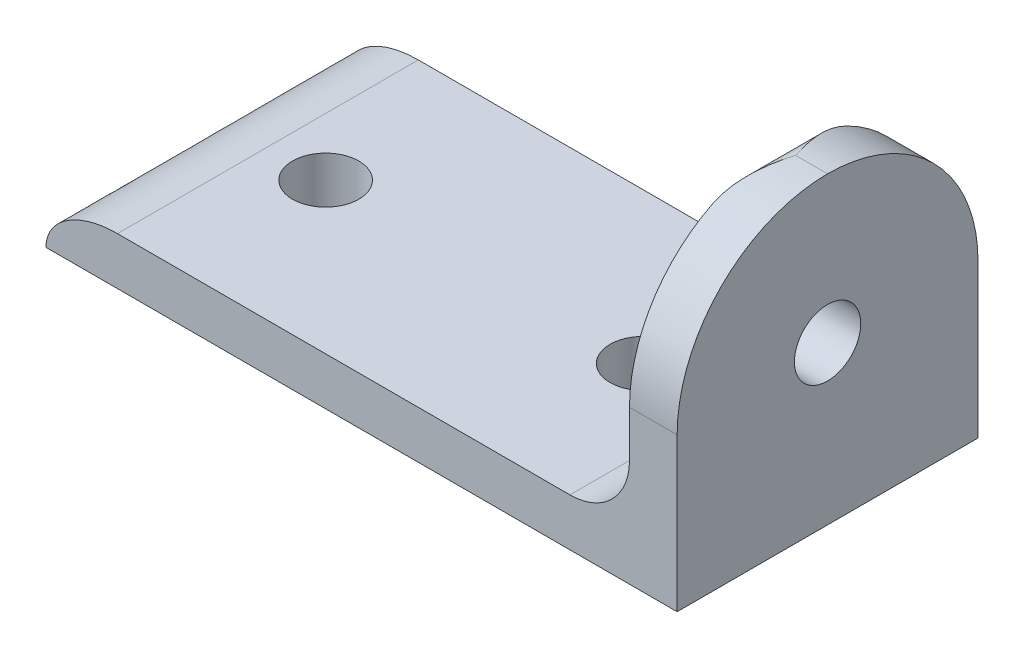
ISO-10303-21;
HEADER;
FILE_DESCRIPTION(('STEP AP214'),'2;1');
FILE_NAME('part.step','',(''),(''),'','','');
FILE_SCHEMA(('AUTOMOTIVE_DESIGN { 1 0 10303 214 1 1 1 1 }'));
ENDSEC;
DATA;
#1=APPLICATION_CONTEXT('core data for automotive mechanical design processes');
#2=APPLICATION_PROTOCOL_DEFINITION('international standard','automotive_design',2000,#1);
#3=PRODUCT_CONTEXT('',#1,'mechanical');
#4=PRODUCT('Part','Part','',(#3));
#5=PRODUCT_RELATED_PRODUCT_CATEGORY('part','',(#4));
#6=PRODUCT_DEFINITION_FORMATION('','',#4);
#7=PRODUCT_DEFINITION_CONTEXT('part definition',#1,'design');
#8=PRODUCT_DEFINITION('design','',#6,#7);
#9=PRODUCT_DEFINITION_SHAPE('','',#8);
#10=(LENGTH_UNIT() NAMED_UNIT(*) SI_UNIT(.MILLI.,.METRE.));
#11=(NAMED_UNIT(*) PLANE_ANGLE_UNIT() SI_UNIT($,.RADIAN.));
#12=(NAMED_UNIT(*) SI_UNIT($,.STERADIAN.) SOLID_ANGLE_UNIT());
#13=UNCERTAINTY_MEASURE_WITH_UNIT(LENGTH_MEASURE(1.E-05),#10,'distance_accuracy_value','');
#14=(GEOMETRIC_REPRESENTATION_CONTEXT(3) GLOBAL_UNCERTAINTY_ASSIGNED_CONTEXT((#13)) GLOBAL_UNIT_ASSIGNED_CONTEXT((#10,
#11,#12)) REPRESENTATION_CONTEXT('',''));
#15=CARTESIAN_POINT('',(0.,0.,0.));
#16=DIRECTION('',(0.,0.,1.));
#17=DIRECTION('',(1.,0.,0.));
#18=AXIS2_PLACEMENT_3D('',#15,#16,#17);
#19=CARTESIAN_POINT('',(-79.5,0.,37.9));
#20=DIRECTION('',(0.,1.,0.));
#21=DIRECTION('',(0.,0.,1.));
#22=AXIS2_PLACEMENT_3D('',#19,#20,#21);
#23=PLANE('',#22);
#24=CARTESIAN_POINT('',(-63.225,0.,18.95));
#25=DIRECTION('',(0.,1.,0.));
#26=DIRECTION('',(0.,0.,1.));
#27=AXIS2_PLACEMENT_3D('',#24,#25,#26);
#28=CIRCLE('',#27,4.175);
#29=CARTESIAN_POINT('',(-63.225,0.,23.125));
#30=VERTEX_POINT('',#29);
#31=EDGE_CURVE('E262',#30,#30,#28,.T.);
#32=ORIENTED_EDGE('',*,*,#31,.T.);
#33=EDGE_LOOP('',(#32));
#34=FACE_BOUND('',#33,.T.);
#35=CARTESIAN_POINT('',(-23.225,0.,18.95));
#36=DIRECTION('',(0.,1.,0.));
#37=DIRECTION('',(0.,0.,1.));
#38=AXIS2_PLACEMENT_3D('',#35,#36,#37);
#39=CIRCLE('',#38,4.175);
#40=CARTESIAN_POINT('',(-23.225,0.,23.125));
#41=VERTEX_POINT('',#40);
#42=EDGE_CURVE('E267',#41,#41,#39,.T.);
#43=ORIENTED_EDGE('',*,*,#42,.T.);
#44=EDGE_LOOP('',(#43));
#45=FACE_BOUND('',#44,.T.);
#46=DIRECTION('',(1.,0.,0.));
#47=VECTOR('',#46,1.);
#48=CARTESIAN_POINT('',(-79.5,0.,0.));
#49=LINE('',#48,#47);
#50=CARTESIAN_POINT('',(-79.5,0.,0.));
#51=VERTEX_POINT('',#50);
#52=CARTESIAN_POINT('',(0.,0.,0.));
#53=VERTEX_POINT('',#52);
#54=EDGE_CURVE('E241',#51,#53,#49,.T.);
#55=ORIENTED_EDGE('',*,*,#54,.T.);
#56=DIRECTION('',(0.,0.,-1.));
#57=VECTOR('',#56,1.);
#58=CARTESIAN_POINT('',(0.,0.,37.9));
#59=LINE('',#58,#57);
#60=CARTESIAN_POINT('',(0.,0.,37.9));
#61=VERTEX_POINT('',#60);
#62=EDGE_CURVE('E116',#61,#53,#59,.T.);
#63=ORIENTED_EDGE('',*,*,#62,.F.);
#64=DIRECTION('',(1.,0.,0.));
#65=VECTOR('',#64,1.);
#66=CARTESIAN_POINT('',(-79.5,0.,37.9));
#67=LINE('',#66,#65);
#68=CARTESIAN_POINT('',(-79.5,0.,37.9));
#69=VERTEX_POINT('',#68);
#70=EDGE_CURVE('E99',#69,#61,#67,.T.);
#71=ORIENTED_EDGE('',*,*,#70,.F.);
#72=CARTESIAN_POINT('',(-79.5,0.,-1.89500000000001));
#73=CARTESIAN_POINT('',(-79.5,0.,12.0016666666667));
#74=CARTESIAN_POINT('',(-79.5,0.,25.8983333333333));
#75=CARTESIAN_POINT('',(-79.5,0.,39.795));
#76=(BOUNDED_CURVE() B_SPLINE_CURVE(3,(#72,#73,#74,#75),.UNSPECIFIED.,.F.,
.F.) B_SPLINE_CURVE_WITH_KNOTS((4,4),(-0.001895,0.039795),
.UNSPECIFIED.) CURVE() GEOMETRIC_REPRESENTATION_ITEM() RATIONAL_B_SPLINE_CURVE((1.,1.,1.,1.)) REPRESENTATION_ITEM(''));
#77=EDGE_CURVE('E113',#69,#51,#76,.F.);
#78=ORIENTED_EDGE('',*,*,#77,.T.);
#79=EDGE_LOOP('',(#55,#63,#71,#78));
#80=FACE_BOUND('',#79,.T.);
#81=ADVANCED_FACE('F20',(#34,#45,#80),#23,.F.);
#82=CARTESIAN_POINT('',(0.,38.3,37.9));
#83=DIRECTION('',(-1.,0.,0.));
#84=DIRECTION('',(0.,-1.,0.));
#85=AXIS2_PLACEMENT_3D('',#82,#83,#84);
#86=PLANE('',#85);
#87=CARTESIAN_POINT('',(0.,19.875,18.95));
#88=DIRECTION('',(1.,0.,0.));
#89=DIRECTION('',(0.,1.,0.));
#90=AXIS2_PLACEMENT_3D('',#87,#88,#89);
#91=CIRCLE('',#90,4.175);
#92=CARTESIAN_POINT('',(0.,24.05,18.95));
#93=VERTEX_POINT('',#92);
#94=EDGE_CURVE('E310',#93,#93,#91,.T.);
#95=ORIENTED_EDGE('',*,*,#94,.F.);
#96=EDGE_LOOP('',(#95));
#97=FACE_BOUND('',#96,.T.);
#98=CARTESIAN_POINT('',(0.,19.3,19.));
#99=DIRECTION('',(-1.,0.,0.));
#100=DIRECTION('',(0.,-1.,0.));
#101=AXIS2_PLACEMENT_3D('',#98,#99,#100);
#102=CIRCLE('',#101,19.);
#103=CARTESIAN_POINT('',(0.,19.3,0.));
#104=VERTEX_POINT('',#103);
#105=CARTESIAN_POINT('',(0.,38.2999342104124,18.95));
#106=VERTEX_POINT('',#105);
#107=EDGE_CURVE('E38',#104,#106,#102,.F.);
#108=ORIENTED_EDGE('',*,*,#107,.T.);
#109=CARTESIAN_POINT('',(0.,19.3,18.9));
#110=DIRECTION('',(-1.,0.,0.));
#111=DIRECTION('',(0.,-1.,0.));
#112=AXIS2_PLACEMENT_3D('',#109,#110,#111);
#113=CIRCLE('',#112,19.);
#114=CARTESIAN_POINT('',(0.,19.3,37.9));
#115=VERTEX_POINT('',#114);
#116=EDGE_CURVE('E30',#106,#115,#113,.F.);
#117=ORIENTED_EDGE('',*,*,#116,.T.);
#118=DIRECTION('',(0.,1.,0.));
#119=VECTOR('',#118,1.);
#120=CARTESIAN_POINT('',(0.,38.3,37.9));
#121=LINE('',#120,#119);
#122=EDGE_CURVE('E118',#61,#115,#121,.T.);
#123=ORIENTED_EDGE('',*,*,#122,.F.);
#124=ORIENTED_EDGE('',*,*,#62,.T.);
#125=DIRECTION('',(0.,1.,0.));
#126=VECTOR('',#125,1.);
#127=CARTESIAN_POINT('',(0.,38.3,0.));
#128=LINE('',#127,#126);
#129=EDGE_CURVE('E238',#53,#104,#128,.T.);
#130=ORIENTED_EDGE('',*,*,#129,.T.);
#131=EDGE_LOOP('',(#108,#117,#123,#124,#130));
#132=FACE_BOUND('',#131,.T.);
#133=ADVANCED_FACE('F201',(#97,#132),#86,.F.);
#134=CARTESIAN_POINT('',(-6.00000000000002,6.,37.9));
#135=DIRECTION('',(1.,0.,0.));
#136=DIRECTION('',(0.,1.,0.));
#137=AXIS2_PLACEMENT_3D('',#134,#135,#136);
#138=PLANE('',#137);
#139=CARTESIAN_POINT('',(-6.00000000000002,19.875,18.95));
#140=DIRECTION('',(1.,0.,0.));
#141=DIRECTION('',(0.,1.,0.));
#142=AXIS2_PLACEMENT_3D('',#139,#140,#141);
#143=CIRCLE('',#142,4.175);
#144=CARTESIAN_POINT('',(-6.00000000000002,24.05,18.95));
#145=VERTEX_POINT('',#144);
#146=EDGE_CURVE('E25',#145,#145,#143,.T.);
#147=ORIENTED_EDGE('',*,*,#146,.T.);
#148=EDGE_LOOP('',(#147));
#149=FACE_BOUND('',#148,.T.);
#150=DIRECTION('',(0.,-1.,0.));
#151=VECTOR('',#150,1.);
#152=CARTESIAN_POINT('',(-6.00000000000002,6.,37.9));
#153=LINE('',#152,#151);
#154=CARTESIAN_POINT('',(-6.00000000000001,19.3,37.9));
#155=VERTEX_POINT('',#154);
#156=CARTESIAN_POINT('',(-6.00000000000001,13.5,37.9));
#157=VERTEX_POINT('',#156);
#158=EDGE_CURVE('E231',#155,#157,#153,.T.);
#159=ORIENTED_EDGE('',*,*,#158,.F.);
#160=CARTESIAN_POINT('',(-6.00000000000001,19.3,18.9));
#161=DIRECTION('',(1.,0.,0.));
#162=DIRECTION('',(0.,1.,0.));
#163=AXIS2_PLACEMENT_3D('',#160,#161,#162);
#164=CIRCLE('',#163,19.);
#165=CARTESIAN_POINT('',(-6.00000000000001,36.3,27.3852813742386));
#166=VERTEX_POINT('',#165);
#167=EDGE_CURVE('E354',#155,#166,#164,.F.);
#168=ORIENTED_EDGE('',*,*,#167,.T.);
#169=DIRECTION('',(0.,0.,-1.));
#170=VECTOR('',#169,1.);
#171=CARTESIAN_POINT('',(-6.00000000000001,36.3,37.9));
#172=LINE('',#171,#170);
#173=CARTESIAN_POINT('',(-6.00000000000001,36.3,10.5147186257614));
#174=VERTEX_POINT('',#173);
#175=EDGE_CURVE('E107',#166,#174,#172,.T.);
#176=ORIENTED_EDGE('',*,*,#175,.T.);
#177=CARTESIAN_POINT('',(-6.00000000000001,19.3,19.));
#178=DIRECTION('',(1.,0.,0.));
#179=DIRECTION('',(0.,1.,0.));
#180=AXIS2_PLACEMENT_3D('',#177,#178,#179);
#181=CIRCLE('',#180,19.);
#182=CARTESIAN_POINT('',(-6.00000000000001,19.3,0.));
#183=VERTEX_POINT('',#182);
#184=EDGE_CURVE('E350',#174,#183,#181,.F.);
#185=ORIENTED_EDGE('',*,*,#184,.T.);
#186=DIRECTION('',(0.,-1.,0.));
#187=VECTOR('',#186,1.);
#188=CARTESIAN_POINT('',(-6.00000000000002,6.,0.));
#189=LINE('',#188,#187);
#190=CARTESIAN_POINT('',(-6.00000000000001,13.5,0.));
#191=VERTEX_POINT('',#190);
#192=EDGE_CURVE('E240',#183,#191,#189,.T.);
#193=ORIENTED_EDGE('',*,*,#192,.T.);
#194=DIRECTION('',(0.,0.,-1.));
#195=VECTOR('',#194,1.);
#196=CARTESIAN_POINT('',(-6.00000000000001,13.5,37.9));
#197=LINE('',#196,#195);
#198=EDGE_CURVE('E440',#191,#157,#197,.F.);
#199=ORIENTED_EDGE('',*,*,#198,.T.);
#200=EDGE_LOOP('',(#159,#168,#176,#185,#193,#199));
#201=FACE_BOUND('',#200,.T.);
#202=ADVANCED_FACE('F205',(#149,#201),#138,.F.);
#203=CARTESIAN_POINT('',(-79.5,6.,37.9));
#204=DIRECTION('',(0.,-1.,0.));
#205=DIRECTION('',(0.,0.,-1.));
#206=AXIS2_PLACEMENT_3D('',#203,#204,#205);
#207=PLANE('',#206);
#208=CARTESIAN_POINT('',(-63.225,6.,18.95));
#209=DIRECTION('',(0.,1.,0.));
#210=DIRECTION('',(0.,0.,1.));
#211=AXIS2_PLACEMENT_3D('',#208,#209,#210);
#212=CIRCLE('',#211,4.175);
#213=CARTESIAN_POINT('',(-63.225,6.,23.125));
#214=VERTEX_POINT('',#213);
#215=EDGE_CURVE('E304',#214,#214,#212,.T.);
#216=ORIENTED_EDGE('',*,*,#215,.F.);
#217=EDGE_LOOP('',(#216));
#218=FACE_BOUND('',#217,.T.);
#219=CARTESIAN_POINT('',(-23.225,6.,18.95));
#220=DIRECTION('',(0.,1.,0.));
#221=DIRECTION('',(0.,0.,1.));
#222=AXIS2_PLACEMENT_3D('',#219,#220,#221);
#223=CIRCLE('',#222,4.175);
#224=CARTESIAN_POINT('',(-23.225,6.,23.125));
#225=VERTEX_POINT('',#224);
#226=EDGE_CURVE('E305',#225,#225,#223,.T.);
#227=ORIENTED_EDGE('',*,*,#226,.F.);
#228=EDGE_LOOP('',(#227));
#229=FACE_BOUND('',#228,.T.);
#230=DIRECTION('',(-1.,0.,0.));
#231=VECTOR('',#230,1.);
#232=CARTESIAN_POINT('',(-79.5,6.,0.));
#233=LINE('',#232,#231);
#234=CARTESIAN_POINT('',(-13.5,6.,0.));
#235=VERTEX_POINT('',#234);
#236=CARTESIAN_POINT('',(-70.5,6.,0.));
#237=VERTEX_POINT('',#236);
#238=EDGE_CURVE('E119',#235,#237,#233,.T.);
#239=ORIENTED_EDGE('',*,*,#238,.T.);
#240=CARTESIAN_POINT('',(-70.5,5.99999999999998,39.795));
#241=CARTESIAN_POINT('',(-70.5,5.99999999999998,25.8983333333333));
#242=CARTESIAN_POINT('',(-70.5,5.99999999999998,12.0016666666667));
#243=CARTESIAN_POINT('',(-70.5,5.99999999999998,-1.89500000000001));
#244=(BOUNDED_CURVE() B_SPLINE_CURVE(3,(#240,#241,#242,#243),.UNSPECIFIED.,.F.,
.F.) B_SPLINE_CURVE_WITH_KNOTS((4,4),(-0.001895,0.039795),
.UNSPECIFIED.) CURVE() GEOMETRIC_REPRESENTATION_ITEM() RATIONAL_B_SPLINE_CURVE((1.,1.,1.,1.)) REPRESENTATION_ITEM(''));
#245=CARTESIAN_POINT('',(-70.5,6.,37.9));
#246=VERTEX_POINT('',#245);
#247=EDGE_CURVE('E108',#237,#246,#244,.F.);
#248=ORIENTED_EDGE('',*,*,#247,.T.);
#249=DIRECTION('',(-1.,0.,0.));
#250=VECTOR('',#249,1.);
#251=CARTESIAN_POINT('',(-79.5,6.,37.9));
#252=LINE('',#251,#250);
#253=CARTESIAN_POINT('',(-13.5,6.,37.9));
#254=VERTEX_POINT('',#253);
#255=EDGE_CURVE('E102',#254,#246,#252,.T.);
#256=ORIENTED_EDGE('',*,*,#255,.F.);
#257=DIRECTION('',(0.,0.,-1.));
#258=VECTOR('',#257,1.);
#259=CARTESIAN_POINT('',(-13.5,6.,0.));
#260=LINE('',#259,#258);
#261=EDGE_CURVE('E126',#254,#235,#260,.T.);
#262=ORIENTED_EDGE('',*,*,#261,.T.);
#263=EDGE_LOOP('',(#239,#248,#256,#262));
#264=FACE_BOUND('',#263,.T.);
#265=ADVANCED_FACE('F209',(#218,#229,#264),#207,.F.);
#266=CARTESIAN_POINT('',(0.,0.,37.9));
#267=DIRECTION('',(0.,0.,-1.));
#268=DIRECTION('',(-1.,0.,0.));
#269=AXIS2_PLACEMENT_3D('',#266,#267,#268);
#270=PLANE('',#269);
#271=ORIENTED_EDGE('',*,*,#122,.T.);
#272=DIRECTION('',(-1.,0.,0.));
#273=VECTOR('',#272,1.);
#274=CARTESIAN_POINT('',(0.,19.3,37.9));
#275=LINE('',#274,#273);
#276=EDGE_CURVE('E299',#115,#155,#275,.T.);
#277=ORIENTED_EDGE('',*,*,#276,.T.);
#278=ORIENTED_EDGE('',*,*,#158,.T.);
#279=CARTESIAN_POINT('',(-13.5,13.5,37.9));
#280=DIRECTION('',(0.,0.,-1.));
#281=DIRECTION('',(-1.,0.,0.));
#282=AXIS2_PLACEMENT_3D('',#279,#280,#281);
#283=CIRCLE('',#282,7.5);
#284=EDGE_CURVE('E249',#157,#254,#283,.T.);
#285=ORIENTED_EDGE('',*,*,#284,.T.);
#286=ORIENTED_EDGE('',*,*,#255,.T.);
#287=CARTESIAN_POINT('',(-79.5,0.,37.9));
#288=CARTESIAN_POINT('',(-79.5,5.99999999999998,37.9));
#289=CARTESIAN_POINT('',(-70.5,5.99999999999998,37.9));
#290=(BOUNDED_CURVE() B_SPLINE_CURVE(2,(#287,#288,#289),.UNSPECIFIED.,.F.,
.F.) B_SPLINE_CURVE_WITH_KNOTS((3,3),(0.,1.),
.UNSPECIFIED.) CURVE() GEOMETRIC_REPRESENTATION_ITEM() RATIONAL_B_SPLINE_CURVE((1.,
0.707106781186548,1.)) REPRESENTATION_ITEM(''));
#291=EDGE_CURVE('E94',#246,#69,#290,.F.);
#292=ORIENTED_EDGE('',*,*,#291,.T.);
#293=ORIENTED_EDGE('',*,*,#70,.T.);
#294=EDGE_LOOP('',(#271,#277,#278,#285,#286,#292,#293));
#295=FACE_BOUND('',#294,.T.);
#296=ADVANCED_FACE('F98',(#295),#270,.F.);
#297=CARTESIAN_POINT('',(0.,0.,0.));
#298=DIRECTION('',(0.,0.,-1.));
#299=DIRECTION('',(-1.,0.,0.));
#300=AXIS2_PLACEMENT_3D('',#297,#298,#299);
#301=PLANE('',#300);
#302=ORIENTED_EDGE('',*,*,#192,.F.);
#303=DIRECTION('',(-1.,0.,0.));
#304=VECTOR('',#303,1.);
#305=CARTESIAN_POINT('',(0.,19.3,0.));
#306=LINE('',#305,#304);
#307=EDGE_CURVE('E11',#183,#104,#306,.F.);
#308=ORIENTED_EDGE('',*,*,#307,.T.);
#309=ORIENTED_EDGE('',*,*,#129,.F.);
#310=ORIENTED_EDGE('',*,*,#54,.F.);
#311=CARTESIAN_POINT('',(-70.5,5.99999999999998,0.));
#312=CARTESIAN_POINT('',(-79.5,5.99999999999998,0.));
#313=CARTESIAN_POINT('',(-79.5,0.,0.));
#314=(BOUNDED_CURVE() B_SPLINE_CURVE(2,(#311,#312,#313),.UNSPECIFIED.,.F.,
.F.) B_SPLINE_CURVE_WITH_KNOTS((3,3),(0.,1.),
.UNSPECIFIED.) CURVE() GEOMETRIC_REPRESENTATION_ITEM() RATIONAL_B_SPLINE_CURVE((1.,
0.707106781186548,1.)) REPRESENTATION_ITEM(''));
#315=EDGE_CURVE('E123',#51,#237,#314,.F.);
#316=ORIENTED_EDGE('',*,*,#315,.T.);
#317=ORIENTED_EDGE('',*,*,#238,.F.);
#318=CARTESIAN_POINT('',(-13.5,13.5,0.));
#319=DIRECTION('',(0.,0.,-1.));
#320=DIRECTION('',(-1.,0.,0.));
#321=AXIS2_PLACEMENT_3D('',#318,#319,#320);
#322=CIRCLE('',#321,7.5);
#323=EDGE_CURVE('E345',#235,#191,#322,.F.);
#324=ORIENTED_EDGE('',*,*,#323,.T.);
#325=EDGE_LOOP('',(#302,#308,#309,#310,#316,#317,#324));
#326=FACE_BOUND('',#325,.T.);
#327=ADVANCED_FACE('F215',(#326),#301,.T.);
#328=CARTESIAN_POINT('',(-13.5,13.5,37.9));
#329=DIRECTION('',(0.,0.,1.));
#330=DIRECTION('',(1.,0.,0.));
#331=AXIS2_PLACEMENT_3D('',#328,#329,#330);
#332=CYLINDRICAL_SURFACE('',#331,7.5);
#333=ORIENTED_EDGE('',*,*,#284,.F.);
#334=ORIENTED_EDGE('',*,*,#198,.F.);
#335=ORIENTED_EDGE('',*,*,#323,.F.);
#336=ORIENTED_EDGE('',*,*,#261,.F.);
#337=EDGE_LOOP('',(#333,#334,#335,#336));
#338=FACE_BOUND('',#337,.T.);
#339=ADVANCED_FACE('F150',(#338),#332,.F.);
#340=CARTESIAN_POINT('',(-79.5,0.,39.795));
#341=CARTESIAN_POINT('',(-79.5,0.,25.8983333333333));
#342=CARTESIAN_POINT('',(-79.5,0.,12.0016666666667));
#343=CARTESIAN_POINT('',(-79.5,0.,-1.89500000000001));
#344=CARTESIAN_POINT('',(-79.5,5.99999999999998,39.795));
#345=CARTESIAN_POINT('',(-79.5,5.99999999999998,25.8983333333333));
#346=CARTESIAN_POINT('',(-79.5,5.99999999999998,12.0016666666667));
#347=CARTESIAN_POINT('',(-79.5,5.99999999999998,-1.89500000000001));
#348=CARTESIAN_POINT('',(-70.5,5.99999999999998,39.795));
#349=CARTESIAN_POINT('',(-70.5,5.99999999999998,25.8983333333333));
#350=CARTESIAN_POINT('',(-70.5,5.99999999999998,12.0016666666667));
#351=CARTESIAN_POINT('',(-70.5,5.99999999999998,-1.89500000000001));
#352=(BOUNDED_SURFACE() B_SPLINE_SURFACE(2,3,((#340,#341,#342,#343),(#344,#345,#346,#347),(#348,
#349,#350,#351)),.UNSPECIFIED.,.F.,.F.,.F.) B_SPLINE_SURFACE_WITH_KNOTS((3,3),(4,4),(0.,1.),
(-0.001895,0.039795),
.UNSPECIFIED.) GEOMETRIC_REPRESENTATION_ITEM() RATIONAL_B_SPLINE_SURFACE(((1.,1.,1.,1.),
(0.707106781186548,0.707106781186548,0.707106781186548,0.707106781186548),(1.,1.,1.,1.))) REPRESENTATION_ITEM('') SURFACE());
#353=ORIENTED_EDGE('',*,*,#291,.F.);
#354=ORIENTED_EDGE('',*,*,#247,.F.);
#355=ORIENTED_EDGE('',*,*,#315,.F.);
#356=ORIENTED_EDGE('',*,*,#77,.F.);
#357=EDGE_LOOP('',(#353,#354,#355,#356));
#358=FACE_BOUND('',#357,.T.);
#359=ADVANCED_FACE('F122',(#358),#352,.T.);
#360=CARTESIAN_POINT('',(-4.00000000000001,36.3,37.9));
#361=DIRECTION('',(0.,0.,-1.));
#362=DIRECTION('',(-1.,0.,0.));
#363=AXIS2_PLACEMENT_3D('',#360,#361,#362);
#364=CYLINDRICAL_SURFACE('',#363,2.);
#365=ORIENTED_EDGE('',*,*,#175,.F.);
#366=CARTESIAN_POINT('',(-6.00000000000001,36.3,27.3852813742386));
#367=CARTESIAN_POINT('',(-5.99997225384459,36.3686292694795,27.2477927781465));
#368=CARTESIAN_POINT('',(-5.99646903465203,36.4355671744704,27.1095028099392));
#369=CARTESIAN_POINT('',(-5.9833290247716,36.5659392218237,26.8316358643278));
#370=CARTESIAN_POINT('',(-5.97369486619967,36.6293748550757,26.6920594645405));
#371=CARTESIAN_POINT('',(-5.94913341125547,36.7525575904173,26.4120960301107));
#372=CARTESIAN_POINT('',(-5.93421669438721,36.812311786633,26.2717111634204));
#373=CARTESIAN_POINT('',(-5.89973037378521,36.928236274419,25.9900273894046));
#374=CARTESIAN_POINT('',(-5.88016020055169,36.9844061262618,25.8487283722641));
#375=CARTESIAN_POINT('',(-5.81551971367979,37.1470413167202,25.4249067583844));
#376=CARTESIAN_POINT('',(-5.76440152241712,37.248171138356,25.1412327956098));
#377=CARTESIAN_POINT('',(-5.64958134577212,37.436228287165,24.5716223710161));
#378=CARTESIAN_POINT('',(-5.58587102488808,37.5231461365447,24.2856845316067));
#379=CARTESIAN_POINT('',(-5.41709159739411,37.7196890966095,23.5801668880439));
#380=CARTESIAN_POINT('',(-5.3064851632796,37.8213458143927,23.1596657780999));
#381=CARTESIAN_POINT('',(-5.07124882936411,37.9952332782539,22.3166771481692));
#382=CARTESIAN_POINT('',(-4.94661606046252,38.0674579899735,21.8941892387778));
#383=CARTESIAN_POINT('',(-4.55951515037866,38.240851620612,20.6244468266042));
#384=CARTESIAN_POINT('',(-4.28377558151544,38.2988113980096,19.7746540814815));
#385=CARTESIAN_POINT('',(-4.00567173268615,38.2999939639084,18.9174815179931));
#386=CARTESIAN_POINT('',(-4.00283583137605,38.2999999953553,18.9087406841636));
#387=CARTESIAN_POINT('',(-4.00000000000001,38.3,18.9));
#388=B_SPLINE_CURVE_WITH_KNOTS('',3,(#366,#367,#368,#369,#370,#371,#372,#373,#374,#375,#376,
#377,#378,#379,#380,#381,#382,#383,#384,#385,#386,#387),.UNSPECIFIED.,.F.,.F.,(4,2,2,2,2,2,2,2,
2,2,4),(0.,0.460890789437376,0.92158384403143,1.38135942751523,1.84119130828856,
2.75682957012233,3.6730759913563,5.01114627205893,6.3494907555443,9.02535252868698,
9.05292063213359),.UNSPECIFIED.);
#389=CARTESIAN_POINT('',(-4.01622202274838,38.2999342104124,18.9499999999999));
#390=VERTEX_POINT('',#389);
#391=EDGE_CURVE('E272',#166,#390,#388,.T.);
#392=ORIENTED_EDGE('',*,*,#391,.T.);
#393=CARTESIAN_POINT('',(-6.00000000000001,36.3,10.5147186257614));
#394=CARTESIAN_POINT('',(-5.99997225384459,36.3686292694795,10.6522072218535));
#395=CARTESIAN_POINT('',(-5.99646903465203,36.4355671744704,10.7904971900608));
#396=CARTESIAN_POINT('',(-5.9833290247716,36.5659392218237,11.0683641356722));
#397=CARTESIAN_POINT('',(-5.97369486619967,36.6293748550757,11.2079405354595));
#398=CARTESIAN_POINT('',(-5.94913341125547,36.7525575904173,11.4879039698893));
#399=CARTESIAN_POINT('',(-5.93421669438721,36.812311786633,11.6282888365796));
#400=CARTESIAN_POINT('',(-5.89973037378521,36.928236274419,11.9099726105954));
#401=CARTESIAN_POINT('',(-5.88016020055169,36.9844061262618,12.0512716277359));
#402=CARTESIAN_POINT('',(-5.81551971367979,37.1470413167202,12.4750932416156));
#403=CARTESIAN_POINT('',(-5.76440152241712,37.248171138356,12.7587672043902));
#404=CARTESIAN_POINT('',(-5.64958134577212,37.436228287165,13.3283776289839));
#405=CARTESIAN_POINT('',(-5.58587102488808,37.5231461365447,13.6143154683933));
#406=CARTESIAN_POINT('',(-5.41709159739411,37.7196890966095,14.3198331119561));
#407=CARTESIAN_POINT('',(-5.3064851632796,37.8213458143927,14.7403342219001));
#408=CARTESIAN_POINT('',(-5.07124882936411,37.9952332782539,15.5833228518308));
#409=CARTESIAN_POINT('',(-4.94661606046252,38.0674579899735,16.0058107612222));
#410=CARTESIAN_POINT('',(-4.55951515037866,38.240851620612,17.2755531733958));
#411=CARTESIAN_POINT('',(-4.28377558151544,38.2988113980096,18.1253459185185));
#412=CARTESIAN_POINT('',(-4.00567173268615,38.2999939639084,18.9825184820069));
#413=CARTESIAN_POINT('',(-4.00283583137605,38.2999999953553,18.9912593158364));
#414=CARTESIAN_POINT('',(-4.00000000000001,38.3,19.));
#415=B_SPLINE_CURVE_WITH_KNOTS('',3,(#393,#394,#395,#396,#397,#398,#399,#400,#401,#402,#403,
#404,#405,#406,#407,#408,#409,#410,#411,#412,#413,#414),.UNSPECIFIED.,.F.,.F.,(4,2,2,2,2,2,2,2,
2,2,4),(0.,0.460890789437382,0.921583844031435,1.38135942751523,1.84119130828857,
2.75682957012233,3.67307599135631,5.01114627205894,6.34949075554431,9.02535252868698,
9.05292063213359),.UNSPECIFIED.);
#416=EDGE_CURVE('E278',#390,#174,#415,.F.);
#417=ORIENTED_EDGE('',*,*,#416,.T.);
#418=EDGE_LOOP('',(#365,#392,#417));
#419=FACE_BOUND('',#418,.T.);
#420=ADVANCED_FACE('F149',(#419),#364,.T.);
#421=CARTESIAN_POINT('',(0.,19.3,19.));
#422=DIRECTION('',(1.,0.,0.));
#423=DIRECTION('',(0.,1.,0.));
#424=AXIS2_PLACEMENT_3D('',#421,#422,#423);
#425=CYLINDRICAL_SURFACE('',#424,19.);
#426=DIRECTION('',(1.,0.,0.));
#427=VECTOR('',#426,1.);
#428=CARTESIAN_POINT('',(-2.99999999999999,38.2999342104124,18.95));
#429=LINE('',#428,#427);
#430=EDGE_CURVE('E260',#106,#390,#429,.F.);
#431=ORIENTED_EDGE('',*,*,#430,.F.);
#432=ORIENTED_EDGE('',*,*,#107,.F.);
#433=ORIENTED_EDGE('',*,*,#307,.F.);
#434=ORIENTED_EDGE('',*,*,#184,.F.);
#435=ORIENTED_EDGE('',*,*,#416,.F.);
#436=EDGE_LOOP('',(#431,#432,#433,#434,#435));
#437=FACE_BOUND('',#436,.T.);
#438=ADVANCED_FACE('F22',(#437),#425,.T.);
#439=CARTESIAN_POINT('',(0.,19.3,18.9));
#440=DIRECTION('',(-1.,0.,0.));
#441=DIRECTION('',(0.,-1.,0.));
#442=AXIS2_PLACEMENT_3D('',#439,#440,#441);
#443=CYLINDRICAL_SURFACE('',#442,19.);
#444=ORIENTED_EDGE('',*,*,#116,.F.);
#445=ORIENTED_EDGE('',*,*,#430,.T.);
#446=ORIENTED_EDGE('',*,*,#391,.F.);
#447=ORIENTED_EDGE('',*,*,#167,.F.);
#448=ORIENTED_EDGE('',*,*,#276,.F.);
#449=EDGE_LOOP('',(#444,#445,#446,#447,#448));
#450=FACE_BOUND('',#449,.T.);
#451=ADVANCED_FACE('F284',(#450),#443,.T.);
#452=CARTESIAN_POINT('',(-23.225,-0.0449999999999999,18.95));
#453=DIRECTION('',(0.,1.,0.));
#454=DIRECTION('',(0.,0.,1.));
#455=AXIS2_PLACEMENT_3D('',#452,#453,#454);
#456=CYLINDRICAL_SURFACE('',#455,4.175);
#457=ORIENTED_EDGE('',*,*,#226,.T.);
#458=EDGE_LOOP('',(#457));
#459=FACE_BOUND('',#458,.T.);
#460=ORIENTED_EDGE('',*,*,#42,.F.);
#461=EDGE_LOOP('',(#460));
#462=FACE_BOUND('',#461,.T.);
#463=ADVANCED_FACE('F287',(#459,#462),#456,.F.);
#464=CARTESIAN_POINT('',(-63.225,-0.0449999999999999,18.95));
#465=DIRECTION('',(0.,1.,0.));
#466=DIRECTION('',(0.,0.,1.));
#467=AXIS2_PLACEMENT_3D('',#464,#465,#466);
#468=CYLINDRICAL_SURFACE('',#467,4.175);
#469=ORIENTED_EDGE('',*,*,#215,.T.);
#470=EDGE_LOOP('',(#469));
#471=FACE_BOUND('',#470,.T.);
#472=ORIENTED_EDGE('',*,*,#31,.F.);
#473=EDGE_LOOP('',(#472));
#474=FACE_BOUND('',#473,.T.);
#475=ADVANCED_FACE('F293',(#471,#474),#468,.F.);
#476=CARTESIAN_POINT('',(-79.545,19.875,18.95));
#477=DIRECTION('',(1.,0.,0.));
#478=DIRECTION('',(0.,1.,0.));
#479=AXIS2_PLACEMENT_3D('',#476,#477,#478);
#480=CYLINDRICAL_SURFACE('',#479,4.175);
#481=ORIENTED_EDGE('',*,*,#94,.T.);
#482=EDGE_LOOP('',(#481));
#483=FACE_BOUND('',#482,.T.);
#484=ORIENTED_EDGE('',*,*,#146,.F.);
#485=EDGE_LOOP('',(#484));
#486=FACE_BOUND('',#485,.T.);
#487=ADVANCED_FACE('F318',(#483,#486),#480,.F.);
#488=CLOSED_SHELL('',(#81,#133,#202,#265,#296,#327,#339,#359,#420,#438,#451,#463,#475,#487));
#489=MANIFOLD_SOLID_BREP('B1',#488);
#490=ADVANCED_BREP_SHAPE_REPRESENTATION('',(#18,#489),#14);
#491=SHAPE_DEFINITION_REPRESENTATION(#9,#490);
ENDSEC;
END-ISO-10303-21;
